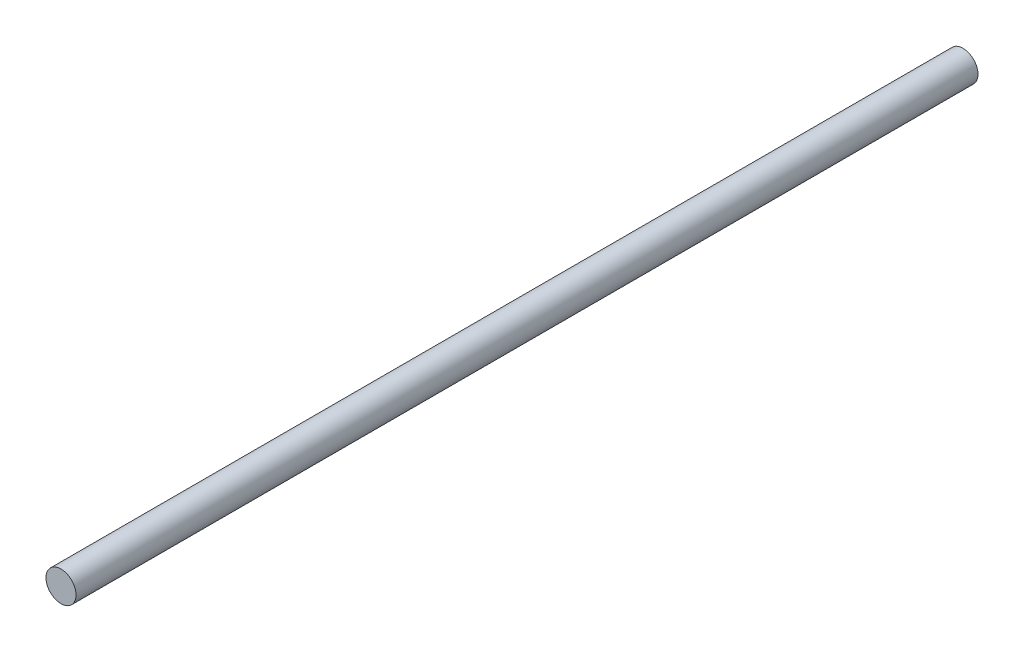
ISO-10303-21;
HEADER;
FILE_DESCRIPTION(('STEP AP214'),'2;1');
FILE_NAME('part.step','',(''),(''),'','','');
FILE_SCHEMA(('AUTOMOTIVE_DESIGN { 1 0 10303 214 1 1 1 1 }'));
ENDSEC;
DATA;
#1=APPLICATION_CONTEXT('core data for automotive mechanical design processes');
#2=APPLICATION_PROTOCOL_DEFINITION('international standard','automotive_design',2000,#1);
#3=PRODUCT_CONTEXT('',#1,'mechanical');
#4=PRODUCT('Part','Part','',(#3));
#5=PRODUCT_RELATED_PRODUCT_CATEGORY('part','',(#4));
#6=PRODUCT_DEFINITION_FORMATION('','',#4);
#7=PRODUCT_DEFINITION_CONTEXT('part definition',#1,'design');
#8=PRODUCT_DEFINITION('design','',#6,#7);
#9=PRODUCT_DEFINITION_SHAPE('','',#8);
#10=(LENGTH_UNIT() NAMED_UNIT(*) SI_UNIT(.MILLI.,.METRE.));
#11=(NAMED_UNIT(*) PLANE_ANGLE_UNIT() SI_UNIT($,.RADIAN.));
#12=(NAMED_UNIT(*) SI_UNIT($,.STERADIAN.) SOLID_ANGLE_UNIT());
#13=UNCERTAINTY_MEASURE_WITH_UNIT(LENGTH_MEASURE(1.E-05),#10,'distance_accuracy_value','');
#14=(GEOMETRIC_REPRESENTATION_CONTEXT(3) GLOBAL_UNCERTAINTY_ASSIGNED_CONTEXT((#13)) GLOBAL_UNIT_ASSIGNED_CONTEXT((#10,
#11,#12)) REPRESENTATION_CONTEXT('',''));
#15=CARTESIAN_POINT('',(0.,0.,0.));
#16=DIRECTION('',(0.,0.,1.));
#17=DIRECTION('',(1.,0.,0.));
#18=AXIS2_PLACEMENT_3D('',#15,#16,#17);
#19=CARTESIAN_POINT('',(0.,0.,600.));
#20=DIRECTION('',(0.,0.,-1.));
#21=DIRECTION('',(-1.,0.,0.));
#22=AXIS2_PLACEMENT_3D('',#19,#20,#21);
#23=CYLINDRICAL_SURFACE('',#22,10.);
#24=CARTESIAN_POINT('',(0.,0.,600.));
#25=DIRECTION('',(0.,0.,1.));
#26=DIRECTION('',(1.,0.,0.));
#27=AXIS2_PLACEMENT_3D('',#24,#25,#26);
#28=CIRCLE('',#27,10.);
#29=CARTESIAN_POINT('',(10.,0.,600.));
#30=VERTEX_POINT('',#29);
#31=EDGE_CURVE('E10',#30,#30,#28,.T.);
#32=ORIENTED_EDGE('',*,*,#31,.F.);
#33=EDGE_LOOP('',(#32));
#34=FACE_BOUND('',#33,.T.);
#35=CARTESIAN_POINT('',(0.,0.,0.));
#36=DIRECTION('',(0.,0.,1.));
#37=DIRECTION('',(1.,0.,0.));
#38=AXIS2_PLACEMENT_3D('',#35,#36,#37);
#39=CIRCLE('',#38,10.);
#40=CARTESIAN_POINT('',(10.,0.,0.));
#41=VERTEX_POINT('',#40);
#42=EDGE_CURVE('E42',#41,#41,#39,.T.);
#43=ORIENTED_EDGE('',*,*,#42,.T.);
#44=EDGE_LOOP('',(#43));
#45=FACE_BOUND('',#44,.T.);
#46=ADVANCED_FACE('F39',(#34,#45),#23,.T.);
#47=CARTESIAN_POINT('',(0.,0.,600.));
#48=DIRECTION('',(0.,0.,1.));
#49=DIRECTION('',(1.,0.,0.));
#50=AXIS2_PLACEMENT_3D('',#47,#48,#49);
#51=PLANE('',#50);
#52=ORIENTED_EDGE('',*,*,#31,.T.);
#53=EDGE_LOOP('',(#52));
#54=FACE_BOUND('',#53,.T.);
#55=ADVANCED_FACE('F56',(#54),#51,.T.);
#56=CARTESIAN_POINT('',(0.,0.,0.));
#57=DIRECTION('',(0.,0.,1.));
#58=DIRECTION('',(1.,0.,0.));
#59=AXIS2_PLACEMENT_3D('',#56,#57,#58);
#60=PLANE('',#59);
#61=ORIENTED_EDGE('',*,*,#42,.F.);
#62=EDGE_LOOP('',(#61));
#63=FACE_BOUND('',#62,.T.);
#64=ADVANCED_FACE('F54',(#63),#60,.F.);
#65=CLOSED_SHELL('',(#46,#55,#64));
#66=MANIFOLD_SOLID_BREP('B2',#65);
#67=ADVANCED_BREP_SHAPE_REPRESENTATION('',(#18,#66),#14);
#68=SHAPE_DEFINITION_REPRESENTATION(#9,#67);
ENDSEC;
END-ISO-10303-21;
